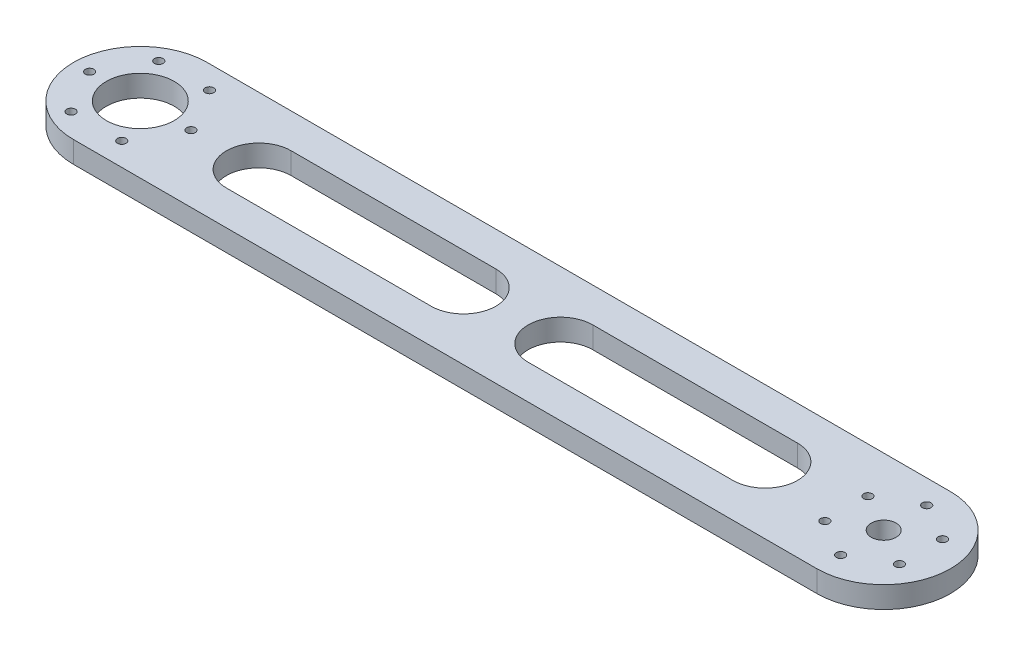
ISO-10303-21;
HEADER;
FILE_DESCRIPTION(('STEP AP214'),'2;1');
FILE_NAME('part.step','',(''),(''),'','','');
FILE_SCHEMA(('AUTOMOTIVE_DESIGN { 1 0 10303 214 1 1 1 1 }'));
ENDSEC;
DATA;
#1=APPLICATION_CONTEXT('core data for automotive mechanical design processes');
#2=APPLICATION_PROTOCOL_DEFINITION('international standard','automotive_design',2000,#1);
#3=PRODUCT_CONTEXT('',#1,'mechanical');
#4=PRODUCT('Part','Part','',(#3));
#5=PRODUCT_RELATED_PRODUCT_CATEGORY('part','',(#4));
#6=PRODUCT_DEFINITION_FORMATION('','',#4);
#7=PRODUCT_DEFINITION_CONTEXT('part definition',#1,'design');
#8=PRODUCT_DEFINITION('design','',#6,#7);
#9=PRODUCT_DEFINITION_SHAPE('','',#8);
#10=(LENGTH_UNIT() NAMED_UNIT(*) SI_UNIT(.MILLI.,.METRE.));
#11=(NAMED_UNIT(*) PLANE_ANGLE_UNIT() SI_UNIT($,.RADIAN.));
#12=(NAMED_UNIT(*) SI_UNIT($,.STERADIAN.) SOLID_ANGLE_UNIT());
#13=UNCERTAINTY_MEASURE_WITH_UNIT(LENGTH_MEASURE(1.E-05),#10,'distance_accuracy_value','');
#14=(GEOMETRIC_REPRESENTATION_CONTEXT(3) GLOBAL_UNCERTAINTY_ASSIGNED_CONTEXT((#13)) GLOBAL_UNIT_ASSIGNED_CONTEXT((#10,
#11,#12)) REPRESENTATION_CONTEXT('',''));
#15=CARTESIAN_POINT('',(0.,0.,0.));
#16=DIRECTION('',(0.,0.,1.));
#17=DIRECTION('',(1.,0.,0.));
#18=AXIS2_PLACEMENT_3D('',#15,#16,#17);
#19=CARTESIAN_POINT('',(-104.546683395043,10.,0.));
#20=DIRECTION('',(0.,1.,0.));
#21=DIRECTION('',(0.,0.,1.));
#22=AXIS2_PLACEMENT_3D('',#19,#20,#21);
#23=PLANE('',#22);
#24=CARTESIAN_POINT('',(-92.8085230633689,10.,20.3447613532394));
#25=DIRECTION('',(0.,1.,0.));
#26=DIRECTION('',(0.,0.,1.));
#27=AXIS2_PLACEMENT_3D('',#24,#25,#26);
#28=CIRCLE('',#27,1.99999999999998);
#29=CARTESIAN_POINT('',(-92.8085230633689,10.,22.3447613532394));
#30=VERTEX_POINT('',#29);
#31=EDGE_CURVE('E196',#30,#30,#28,.T.);
#32=ORIENTED_EDGE('',*,*,#31,.F.);
#33=EDGE_LOOP('',(#32));
#34=FACE_BOUND('',#33,.T.);
#35=CARTESIAN_POINT('',(-92.8085230633687,10.,-20.3447613532391));
#36=DIRECTION('',(0.,1.,0.));
#37=DIRECTION('',(0.,0.,1.));
#38=AXIS2_PLACEMENT_3D('',#35,#36,#37);
#39=CIRCLE('',#38,2.);
#40=CARTESIAN_POINT('',(-92.8085230633687,10.,-18.3447613532391));
#41=VERTEX_POINT('',#40);
#42=EDGE_CURVE('E208',#41,#41,#39,.T.);
#43=ORIENTED_EDGE('',*,*,#42,.F.);
#44=EDGE_LOOP('',(#43));
#45=FACE_BOUND('',#44,.T.);
#46=CARTESIAN_POINT('',(240.44542349274,10.,19.9863287286099));
#47=DIRECTION('',(0.,1.,0.));
#48=DIRECTION('',(0.,0.,1.));
#49=AXIS2_PLACEMENT_3D('',#46,#47,#48);
#50=CIRCLE('',#49,2.00000000000003);
#51=CARTESIAN_POINT('',(240.44542349274,10.,21.98632872861));
#52=VERTEX_POINT('',#51);
#53=EDGE_CURVE('E220',#52,#52,#50,.T.);
#54=ORIENTED_EDGE('',*,*,#53,.F.);
#55=EDGE_LOOP('',(#54));
#56=FACE_BOUND('',#55,.T.);
#57=CARTESIAN_POINT('',(257.750145343994,10.,9.98632872861002));
#58=DIRECTION('',(0.,1.,0.));
#59=DIRECTION('',(0.,0.,1.));
#60=AXIS2_PLACEMENT_3D('',#57,#58,#59);
#61=CIRCLE('',#60,2.);
#62=CARTESIAN_POINT('',(257.750145343994,10.,11.98632872861));
#63=VERTEX_POINT('',#62);
#64=EDGE_CURVE('E232',#63,#63,#61,.T.);
#65=ORIENTED_EDGE('',*,*,#64,.F.);
#66=EDGE_LOOP('',(#65));
#67=FACE_BOUND('',#66,.T.);
#68=CARTESIAN_POINT('',(240.429637268305,10.,-19.9863287286099));
#69=DIRECTION('',(0.,1.,0.));
#70=DIRECTION('',(0.,0.,1.));
#71=AXIS2_PLACEMENT_3D('',#68,#69,#70);
#72=CIRCLE('',#71,1.99999999999997);
#73=CARTESIAN_POINT('',(240.429637268305,10.,-17.98632872861));
#74=VERTEX_POINT('',#73);
#75=EDGE_CURVE('E244',#74,#74,#72,.T.);
#76=ORIENTED_EDGE('',*,*,#75,.F.);
#77=EDGE_LOOP('',(#76));
#78=FACE_BOUND('',#77,.T.);
#79=CARTESIAN_POINT('',(223.132808529268,10.,9.99999999999991));
#80=DIRECTION('',(0.,1.,0.));
#81=DIRECTION('',(0.,0.,1.));
#82=AXIS2_PLACEMENT_3D('',#79,#80,#81);
#83=CIRCLE('',#82,2.);
#84=CARTESIAN_POINT('',(223.132808529268,10.,11.9999999999999));
#85=VERTEX_POINT('',#84);
#86=EDGE_CURVE('E256',#85,#85,#83,.T.);
#87=ORIENTED_EDGE('',*,*,#86,.F.);
#88=EDGE_LOOP('',(#87));
#89=FACE_BOUND('',#88,.T.);
#90=CARTESIAN_POINT('',(-104.546683395043,10.,0.));
#91=DIRECTION('',(0.,1.,0.));
#92=DIRECTION('',(0.,0.,1.));
#93=AXIS2_PLACEMENT_3D('',#90,#91,#92);
#94=CIRCLE('',#93,15.75);
#95=CARTESIAN_POINT('',(-104.546683395043,10.,15.75));
#96=VERTEX_POINT('',#95);
#97=EDGE_CURVE('E268',#96,#96,#94,.T.);
#98=ORIENTED_EDGE('',*,*,#97,.F.);
#99=EDGE_LOOP('',(#98));
#100=FACE_BOUND('',#99,.T.);
#101=CARTESIAN_POINT('',(-104.546683395043,10.,0.));
#102=DIRECTION('',(0.,1.,0.));
#103=DIRECTION('',(0.,0.,1.));
#104=AXIS2_PLACEMENT_3D('',#101,#102,#103);
#105=CIRCLE('',#104,31.);
#106=CARTESIAN_POINT('',(-104.546683395043,10.,-31.));
#107=VERTEX_POINT('',#106);
#108=CARTESIAN_POINT('',(-104.546683395043,10.,31.));
#109=VERTEX_POINT('',#108);
#110=EDGE_CURVE('E274',#107,#109,#105,.T.);
#111=ORIENTED_EDGE('',*,*,#110,.T.);
#112=DIRECTION('',(1.,0.,0.));
#113=VECTOR('',#112,1.);
#114=CARTESIAN_POINT('',(-104.546683395043,10.,31.));
#115=LINE('',#114,#113);
#116=CARTESIAN_POINT('',(240.453316604957,10.,31.));
#117=VERTEX_POINT('',#116);
#118=EDGE_CURVE('E277',#109,#117,#115,.T.);
#119=ORIENTED_EDGE('',*,*,#118,.T.);
#120=CARTESIAN_POINT('',(240.453316604957,10.,0.));
#121=DIRECTION('',(0.,1.,0.));
#122=DIRECTION('',(0.,0.,1.));
#123=AXIS2_PLACEMENT_3D('',#120,#121,#122);
#124=CIRCLE('',#123,31.);
#125=CARTESIAN_POINT('',(240.453316604957,10.,-31.));
#126=VERTEX_POINT('',#125);
#127=EDGE_CURVE('E280',#117,#126,#124,.T.);
#128=ORIENTED_EDGE('',*,*,#127,.T.);
#129=DIRECTION('',(-1.,0.,0.));
#130=VECTOR('',#129,1.);
#131=CARTESIAN_POINT('',(-104.546683395043,10.,-31.));
#132=LINE('',#131,#130);
#133=EDGE_CURVE('E282',#126,#107,#132,.T.);
#134=ORIENTED_EDGE('',*,*,#133,.T.);
#135=EDGE_LOOP('',(#111,#119,#128,#134));
#136=FACE_BOUND('',#135,.T.);
#137=CARTESIAN_POINT('',(240.453316604957,10.,0.));
#138=DIRECTION('',(0.,1.,0.));
#139=DIRECTION('',(0.,0.,1.));
#140=AXIS2_PLACEMENT_3D('',#137,#138,#139);
#141=CIRCLE('',#140,5.75);
#142=CARTESIAN_POINT('',(240.453316604957,10.,5.75));
#143=VERTEX_POINT('',#142);
#144=EDGE_CURVE('E262',#143,#143,#141,.T.);
#145=ORIENTED_EDGE('',*,*,#144,.F.);
#146=EDGE_LOOP('',(#145));
#147=FACE_BOUND('',#146,.T.);
#148=CARTESIAN_POINT('',(223.124915417051,10.,-9.98632872861002));
#149=DIRECTION('',(0.,1.,0.));
#150=DIRECTION('',(0.,0.,1.));
#151=AXIS2_PLACEMENT_3D('',#148,#149,#150);
#152=CIRCLE('',#151,2.00000000000003);
#153=CARTESIAN_POINT('',(223.124915417051,10.,-7.98632872861));
#154=VERTEX_POINT('',#153);
#155=EDGE_CURVE('E250',#154,#154,#152,.T.);
#156=ORIENTED_EDGE('',*,*,#155,.F.);
#157=EDGE_LOOP('',(#156));
#158=FACE_BOUND('',#157,.T.);
#159=CARTESIAN_POINT('',(257.742252231777,10.,-9.9999999999999));
#160=DIRECTION('',(0.,1.,0.));
#161=DIRECTION('',(0.,0.,1.));
#162=AXIS2_PLACEMENT_3D('',#159,#160,#161);
#163=CIRCLE('',#162,2.00000000000005);
#164=CARTESIAN_POINT('',(257.742252231777,10.,-7.99999999999985));
#165=VERTEX_POINT('',#164);
#166=EDGE_CURVE('E238',#165,#165,#163,.T.);
#167=ORIENTED_EDGE('',*,*,#166,.F.);
#168=EDGE_LOOP('',(#167));
#169=FACE_BOUND('',#168,.T.);
#170=CARTESIAN_POINT('',(-128.046683395043,10.,0.));
#171=DIRECTION('',(0.,1.,0.));
#172=DIRECTION('',(0.,0.,1.));
#173=AXIS2_PLACEMENT_3D('',#170,#171,#172);
#174=CIRCLE('',#173,2.);
#175=CARTESIAN_POINT('',(-128.046683395043,10.,2.));
#176=VERTEX_POINT('',#175);
#177=EDGE_CURVE('E226',#176,#176,#174,.T.);
#178=ORIENTED_EDGE('',*,*,#177,.F.);
#179=EDGE_LOOP('',(#178));
#180=FACE_BOUND('',#179,.T.);
#181=CARTESIAN_POINT('',(-116.300629951151,10.,-20.3447613532392));
#182=DIRECTION('',(0.,1.,0.));
#183=DIRECTION('',(0.,0.,1.));
#184=AXIS2_PLACEMENT_3D('',#181,#182,#183);
#185=CIRCLE('',#184,2.);
#186=CARTESIAN_POINT('',(-116.300629951151,10.,-18.3447613532392));
#187=VERTEX_POINT('',#186);
#188=EDGE_CURVE('E214',#187,#187,#185,.T.);
#189=ORIENTED_EDGE('',*,*,#188,.F.);
#190=EDGE_LOOP('',(#189));
#191=FACE_BOUND('',#190,.T.);
#192=CARTESIAN_POINT('',(-81.0624696194774,10.,1.64099622925627E-13));
#193=DIRECTION('',(0.,1.,0.));
#194=DIRECTION('',(0.,0.,1.));
#195=AXIS2_PLACEMENT_3D('',#192,#193,#194);
#196=CIRCLE('',#195,1.99999999999999);
#197=CARTESIAN_POINT('',(-81.0624696194774,10.,2.00000000000016));
#198=VERTEX_POINT('',#197);
#199=EDGE_CURVE('E202',#198,#198,#196,.T.);
#200=ORIENTED_EDGE('',*,*,#199,.F.);
#201=EDGE_LOOP('',(#200));
#202=FACE_BOUND('',#201,.T.);
#203=CARTESIAN_POINT('',(-116.300629951152,10.,20.3447613532393));
#204=DIRECTION('',(0.,1.,0.));
#205=DIRECTION('',(0.,0.,1.));
#206=AXIS2_PLACEMENT_3D('',#203,#204,#205);
#207=CIRCLE('',#206,1.99999999999998);
#208=CARTESIAN_POINT('',(-116.300629951152,10.,22.3447613532393));
#209=VERTEX_POINT('',#208);
#210=EDGE_CURVE('E190',#209,#209,#207,.T.);
#211=ORIENTED_EDGE('',*,*,#210,.F.);
#212=EDGE_LOOP('',(#211));
#213=FACE_BOUND('',#212,.T.);
#214=DIRECTION('',(1.,0.,0.));
#215=VECTOR('',#214,1.);
#216=CARTESIAN_POINT('',(-49.5466833950429,10.,15.));
#217=LINE('',#216,#215);
#218=CARTESIAN_POINT('',(-49.5466833950429,10.,15.));
#219=VERTEX_POINT('',#218);
#220=CARTESIAN_POINT('',(45.4533166049571,10.,15.));
#221=VERTEX_POINT('',#220);
#222=EDGE_CURVE('E161',#219,#221,#217,.T.);
#223=ORIENTED_EDGE('',*,*,#222,.F.);
#224=CARTESIAN_POINT('',(-49.5466833950429,10.,0.));
#225=DIRECTION('',(0.,1.,0.));
#226=DIRECTION('',(0.,0.,1.));
#227=AXIS2_PLACEMENT_3D('',#224,#225,#226);
#228=CIRCLE('',#227,15.);
#229=CARTESIAN_POINT('',(-49.5466833950429,10.,-15.));
#230=VERTEX_POINT('',#229);
#231=EDGE_CURVE('E159',#230,#219,#228,.T.);
#232=ORIENTED_EDGE('',*,*,#231,.F.);
#233=DIRECTION('',(-1.,0.,0.));
#234=VECTOR('',#233,1.);
#235=CARTESIAN_POINT('',(-49.5466833950429,10.,-15.));
#236=LINE('',#235,#234);
#237=CARTESIAN_POINT('',(45.4533166049571,10.,-15.));
#238=VERTEX_POINT('',#237);
#239=EDGE_CURVE('E167',#238,#230,#236,.T.);
#240=ORIENTED_EDGE('',*,*,#239,.F.);
#241=CARTESIAN_POINT('',(45.4533166049571,10.,0.));
#242=DIRECTION('',(0.,1.,0.));
#243=DIRECTION('',(0.,0.,1.));
#244=AXIS2_PLACEMENT_3D('',#241,#242,#243);
#245=CIRCLE('',#244,15.);
#246=EDGE_CURVE('E164',#221,#238,#245,.T.);
#247=ORIENTED_EDGE('',*,*,#246,.F.);
#248=EDGE_LOOP('',(#223,#232,#240,#247));
#249=FACE_BOUND('',#248,.T.);
#250=DIRECTION('',(1.,0.,0.));
#251=VECTOR('',#250,1.);
#252=CARTESIAN_POINT('',(90.4533166049571,10.,15.));
#253=LINE('',#252,#251);
#254=CARTESIAN_POINT('',(90.4533166049571,10.,15.));
#255=VERTEX_POINT('',#254);
#256=CARTESIAN_POINT('',(185.453316604957,10.,15.));
#257=VERTEX_POINT('',#256);
#258=EDGE_CURVE('E131',#255,#257,#253,.T.);
#259=ORIENTED_EDGE('',*,*,#258,.F.);
#260=CARTESIAN_POINT('',(90.4533166049571,10.,0.));
#261=DIRECTION('',(0.,1.,0.));
#262=DIRECTION('',(0.,0.,1.));
#263=AXIS2_PLACEMENT_3D('',#260,#261,#262);
#264=CIRCLE('',#263,15.);
#265=CARTESIAN_POINT('',(90.4533166049571,10.,-15.));
#266=VERTEX_POINT('',#265);
#267=EDGE_CURVE('E123',#266,#255,#264,.T.);
#268=ORIENTED_EDGE('',*,*,#267,.F.);
#269=DIRECTION('',(-1.,0.,0.));
#270=VECTOR('',#269,1.);
#271=CARTESIAN_POINT('',(90.4533166049571,10.,-15.));
#272=LINE('',#271,#270);
#273=CARTESIAN_POINT('',(185.453316604957,10.,-15.));
#274=VERTEX_POINT('',#273);
#275=EDGE_CURVE('E145',#274,#266,#272,.T.);
#276=ORIENTED_EDGE('',*,*,#275,.F.);
#277=CARTESIAN_POINT('',(185.453316604957,10.,0.));
#278=DIRECTION('',(0.,1.,0.));
#279=DIRECTION('',(0.,0.,1.));
#280=AXIS2_PLACEMENT_3D('',#277,#278,#279);
#281=CIRCLE('',#280,15.);
#282=EDGE_CURVE('E143',#257,#274,#281,.T.);
#283=ORIENTED_EDGE('',*,*,#282,.F.);
#284=EDGE_LOOP('',(#259,#268,#276,#283));
#285=FACE_BOUND('',#284,.T.);
#286=ADVANCED_FACE('F34',(#34,#45,#56,#67,#78,#89,#100,#136,#147,#158,#169,#180,#191,#202,#213,
#249,#285),#23,.T.);
#287=CARTESIAN_POINT('',(-104.546683395043,0.,0.));
#288=DIRECTION('',(0.,1.,0.));
#289=DIRECTION('',(0.,0.,1.));
#290=AXIS2_PLACEMENT_3D('',#287,#288,#289);
#291=PLANE('',#290);
#292=CARTESIAN_POINT('',(-49.5466833950429,0.,0.));
#293=DIRECTION('',(0.,1.,0.));
#294=DIRECTION('',(0.,0.,1.));
#295=AXIS2_PLACEMENT_3D('',#292,#293,#294);
#296=CIRCLE('',#295,15.);
#297=CARTESIAN_POINT('',(-49.5466833950429,0.,-15.));
#298=VERTEX_POINT('',#297);
#299=CARTESIAN_POINT('',(-49.5466833950429,0.,15.));
#300=VERTEX_POINT('',#299);
#301=EDGE_CURVE('E139',#298,#300,#296,.T.);
#302=ORIENTED_EDGE('',*,*,#301,.T.);
#303=DIRECTION('',(1.,0.,0.));
#304=VECTOR('',#303,1.);
#305=CARTESIAN_POINT('',(-49.5466833950429,0.,15.));
#306=LINE('',#305,#304);
#307=CARTESIAN_POINT('',(45.4533166049571,0.,15.));
#308=VERTEX_POINT('',#307);
#309=EDGE_CURVE('E172',#300,#308,#306,.T.);
#310=ORIENTED_EDGE('',*,*,#309,.T.);
#311=CARTESIAN_POINT('',(45.4533166049571,0.,0.));
#312=DIRECTION('',(0.,1.,0.));
#313=DIRECTION('',(0.,0.,1.));
#314=AXIS2_PLACEMENT_3D('',#311,#312,#313);
#315=CIRCLE('',#314,15.);
#316=CARTESIAN_POINT('',(45.4533166049571,0.,-15.));
#317=VERTEX_POINT('',#316);
#318=EDGE_CURVE('E175',#308,#317,#315,.T.);
#319=ORIENTED_EDGE('',*,*,#318,.T.);
#320=DIRECTION('',(-1.,0.,0.));
#321=VECTOR('',#320,1.);
#322=CARTESIAN_POINT('',(-49.5466833950429,0.,-15.));
#323=LINE('',#322,#321);
#324=EDGE_CURVE('E162',#317,#298,#323,.T.);
#325=ORIENTED_EDGE('',*,*,#324,.T.);
#326=EDGE_LOOP('',(#302,#310,#319,#325));
#327=FACE_BOUND('',#326,.T.);
#328=CARTESIAN_POINT('',(-104.546683395043,0.,0.));
#329=DIRECTION('',(0.,1.,0.));
#330=DIRECTION('',(0.,0.,1.));
#331=AXIS2_PLACEMENT_3D('',#328,#329,#330);
#332=CIRCLE('',#331,31.);
#333=CARTESIAN_POINT('',(-104.546683395043,0.,-31.));
#334=VERTEX_POINT('',#333);
#335=CARTESIAN_POINT('',(-104.546683395043,0.,31.));
#336=VERTEX_POINT('',#335);
#337=EDGE_CURVE('E271',#334,#336,#332,.T.);
#338=ORIENTED_EDGE('',*,*,#337,.F.);
#339=DIRECTION('',(-1.,0.,0.));
#340=VECTOR('',#339,1.);
#341=CARTESIAN_POINT('',(-104.546683395043,0.,-31.));
#342=LINE('',#341,#340);
#343=CARTESIAN_POINT('',(240.453316604957,0.,-31.));
#344=VERTEX_POINT('',#343);
#345=EDGE_CURVE('E278',#344,#334,#342,.T.);
#346=ORIENTED_EDGE('',*,*,#345,.F.);
#347=CARTESIAN_POINT('',(240.453316604957,0.,0.));
#348=DIRECTION('',(0.,1.,0.));
#349=DIRECTION('',(0.,0.,1.));
#350=AXIS2_PLACEMENT_3D('',#347,#348,#349);
#351=CIRCLE('',#350,31.);
#352=CARTESIAN_POINT('',(240.453316604957,0.,31.));
#353=VERTEX_POINT('',#352);
#354=EDGE_CURVE('E289',#353,#344,#351,.T.);
#355=ORIENTED_EDGE('',*,*,#354,.F.);
#356=DIRECTION('',(1.,0.,0.));
#357=VECTOR('',#356,1.);
#358=CARTESIAN_POINT('',(-104.546683395043,0.,31.));
#359=LINE('',#358,#357);
#360=EDGE_CURVE('E287',#336,#353,#359,.T.);
#361=ORIENTED_EDGE('',*,*,#360,.F.);
#362=EDGE_LOOP('',(#338,#346,#355,#361));
#363=FACE_BOUND('',#362,.T.);
#364=CARTESIAN_POINT('',(-104.546683395043,0.,0.));
#365=DIRECTION('',(0.,1.,0.));
#366=DIRECTION('',(0.,0.,1.));
#367=AXIS2_PLACEMENT_3D('',#364,#365,#366);
#368=CIRCLE('',#367,15.75);
#369=CARTESIAN_POINT('',(-104.546683395043,0.,15.75));
#370=VERTEX_POINT('',#369);
#371=EDGE_CURVE('E265',#370,#370,#368,.T.);
#372=ORIENTED_EDGE('',*,*,#371,.T.);
#373=EDGE_LOOP('',(#372));
#374=FACE_BOUND('',#373,.T.);
#375=CARTESIAN_POINT('',(240.453316604957,0.,0.));
#376=DIRECTION('',(0.,1.,0.));
#377=DIRECTION('',(0.,0.,1.));
#378=AXIS2_PLACEMENT_3D('',#375,#376,#377);
#379=CIRCLE('',#378,5.75);
#380=CARTESIAN_POINT('',(240.453316604957,0.,5.75));
#381=VERTEX_POINT('',#380);
#382=EDGE_CURVE('E259',#381,#381,#379,.T.);
#383=ORIENTED_EDGE('',*,*,#382,.T.);
#384=EDGE_LOOP('',(#383));
#385=FACE_BOUND('',#384,.T.);
#386=CARTESIAN_POINT('',(223.132808529268,0.,9.99999999999991));
#387=DIRECTION('',(0.,1.,0.));
#388=DIRECTION('',(0.,0.,1.));
#389=AXIS2_PLACEMENT_3D('',#386,#387,#388);
#390=CIRCLE('',#389,2.);
#391=CARTESIAN_POINT('',(223.132808529268,0.,11.9999999999999));
#392=VERTEX_POINT('',#391);
#393=EDGE_CURVE('E253',#392,#392,#390,.T.);
#394=ORIENTED_EDGE('',*,*,#393,.T.);
#395=EDGE_LOOP('',(#394));
#396=FACE_BOUND('',#395,.T.);
#397=CARTESIAN_POINT('',(223.124915417051,0.,-9.98632872861002));
#398=DIRECTION('',(0.,1.,0.));
#399=DIRECTION('',(0.,0.,1.));
#400=AXIS2_PLACEMENT_3D('',#397,#398,#399);
#401=CIRCLE('',#400,2.00000000000003);
#402=CARTESIAN_POINT('',(223.124915417051,0.,-7.98632872861));
#403=VERTEX_POINT('',#402);
#404=EDGE_CURVE('E247',#403,#403,#401,.T.);
#405=ORIENTED_EDGE('',*,*,#404,.T.);
#406=EDGE_LOOP('',(#405));
#407=FACE_BOUND('',#406,.T.);
#408=CARTESIAN_POINT('',(240.429637268305,0.,-19.9863287286099));
#409=DIRECTION('',(0.,1.,0.));
#410=DIRECTION('',(0.,0.,1.));
#411=AXIS2_PLACEMENT_3D('',#408,#409,#410);
#412=CIRCLE('',#411,1.99999999999997);
#413=CARTESIAN_POINT('',(240.429637268305,0.,-17.98632872861));
#414=VERTEX_POINT('',#413);
#415=EDGE_CURVE('E241',#414,#414,#412,.T.);
#416=ORIENTED_EDGE('',*,*,#415,.T.);
#417=EDGE_LOOP('',(#416));
#418=FACE_BOUND('',#417,.T.);
#419=CARTESIAN_POINT('',(257.742252231777,0.,-9.9999999999999));
#420=DIRECTION('',(0.,1.,0.));
#421=DIRECTION('',(0.,0.,1.));
#422=AXIS2_PLACEMENT_3D('',#419,#420,#421);
#423=CIRCLE('',#422,2.00000000000005);
#424=CARTESIAN_POINT('',(257.742252231777,0.,-7.99999999999985));
#425=VERTEX_POINT('',#424);
#426=EDGE_CURVE('E235',#425,#425,#423,.T.);
#427=ORIENTED_EDGE('',*,*,#426,.T.);
#428=EDGE_LOOP('',(#427));
#429=FACE_BOUND('',#428,.T.);
#430=CARTESIAN_POINT('',(257.750145343994,0.,9.98632872861002));
#431=DIRECTION('',(0.,1.,0.));
#432=DIRECTION('',(0.,0.,1.));
#433=AXIS2_PLACEMENT_3D('',#430,#431,#432);
#434=CIRCLE('',#433,2.);
#435=CARTESIAN_POINT('',(257.750145343994,0.,11.98632872861));
#436=VERTEX_POINT('',#435);
#437=EDGE_CURVE('E229',#436,#436,#434,.T.);
#438=ORIENTED_EDGE('',*,*,#437,.T.);
#439=EDGE_LOOP('',(#438));
#440=FACE_BOUND('',#439,.T.);
#441=CARTESIAN_POINT('',(-128.046683395043,0.,0.));
#442=DIRECTION('',(0.,1.,0.));
#443=DIRECTION('',(0.,0.,1.));
#444=AXIS2_PLACEMENT_3D('',#441,#442,#443);
#445=CIRCLE('',#444,2.);
#446=CARTESIAN_POINT('',(-128.046683395043,0.,2.));
#447=VERTEX_POINT('',#446);
#448=EDGE_CURVE('E223',#447,#447,#445,.T.);
#449=ORIENTED_EDGE('',*,*,#448,.T.);
#450=EDGE_LOOP('',(#449));
#451=FACE_BOUND('',#450,.T.);
#452=CARTESIAN_POINT('',(240.44542349274,0.,19.9863287286099));
#453=DIRECTION('',(0.,1.,0.));
#454=DIRECTION('',(0.,0.,1.));
#455=AXIS2_PLACEMENT_3D('',#452,#453,#454);
#456=CIRCLE('',#455,2.00000000000003);
#457=CARTESIAN_POINT('',(240.44542349274,0.,21.98632872861));
#458=VERTEX_POINT('',#457);
#459=EDGE_CURVE('E217',#458,#458,#456,.T.);
#460=ORIENTED_EDGE('',*,*,#459,.T.);
#461=EDGE_LOOP('',(#460));
#462=FACE_BOUND('',#461,.T.);
#463=CARTESIAN_POINT('',(-116.300629951151,0.,-20.3447613532392));
#464=DIRECTION('',(0.,1.,0.));
#465=DIRECTION('',(0.,0.,1.));
#466=AXIS2_PLACEMENT_3D('',#463,#464,#465);
#467=CIRCLE('',#466,2.);
#468=CARTESIAN_POINT('',(-116.300629951151,0.,-18.3447613532392));
#469=VERTEX_POINT('',#468);
#470=EDGE_CURVE('E211',#469,#469,#467,.T.);
#471=ORIENTED_EDGE('',*,*,#470,.T.);
#472=EDGE_LOOP('',(#471));
#473=FACE_BOUND('',#472,.T.);
#474=CARTESIAN_POINT('',(-92.8085230633687,0.,-20.3447613532391));
#475=DIRECTION('',(0.,1.,0.));
#476=DIRECTION('',(0.,0.,1.));
#477=AXIS2_PLACEMENT_3D('',#474,#475,#476);
#478=CIRCLE('',#477,2.);
#479=CARTESIAN_POINT('',(-92.8085230633687,0.,-18.3447613532391));
#480=VERTEX_POINT('',#479);
#481=EDGE_CURVE('E205',#480,#480,#478,.T.);
#482=ORIENTED_EDGE('',*,*,#481,.T.);
#483=EDGE_LOOP('',(#482));
#484=FACE_BOUND('',#483,.T.);
#485=CARTESIAN_POINT('',(-81.0624696194774,0.,1.64099622925627E-13));
#486=DIRECTION('',(0.,1.,0.));
#487=DIRECTION('',(0.,0.,1.));
#488=AXIS2_PLACEMENT_3D('',#485,#486,#487);
#489=CIRCLE('',#488,1.99999999999999);
#490=CARTESIAN_POINT('',(-81.0624696194774,0.,2.00000000000016));
#491=VERTEX_POINT('',#490);
#492=EDGE_CURVE('E199',#491,#491,#489,.T.);
#493=ORIENTED_EDGE('',*,*,#492,.T.);
#494=EDGE_LOOP('',(#493));
#495=FACE_BOUND('',#494,.T.);
#496=CARTESIAN_POINT('',(-92.8085230633689,0.,20.3447613532394));
#497=DIRECTION('',(0.,1.,0.));
#498=DIRECTION('',(0.,0.,1.));
#499=AXIS2_PLACEMENT_3D('',#496,#497,#498);
#500=CIRCLE('',#499,1.99999999999998);
#501=CARTESIAN_POINT('',(-92.8085230633689,0.,22.3447613532394));
#502=VERTEX_POINT('',#501);
#503=EDGE_CURVE('E193',#502,#502,#500,.T.);
#504=ORIENTED_EDGE('',*,*,#503,.T.);
#505=EDGE_LOOP('',(#504));
#506=FACE_BOUND('',#505,.T.);
#507=CARTESIAN_POINT('',(-116.300629951152,0.,20.3447613532393));
#508=DIRECTION('',(0.,1.,0.));
#509=DIRECTION('',(0.,0.,1.));
#510=AXIS2_PLACEMENT_3D('',#507,#508,#509);
#511=CIRCLE('',#510,1.99999999999998);
#512=CARTESIAN_POINT('',(-116.300629951152,0.,22.3447613532393));
#513=VERTEX_POINT('',#512);
#514=EDGE_CURVE('E189',#513,#513,#511,.T.);
#515=ORIENTED_EDGE('',*,*,#514,.T.);
#516=EDGE_LOOP('',(#515));
#517=FACE_BOUND('',#516,.T.);
#518=CARTESIAN_POINT('',(90.4533166049571,0.,0.));
#519=DIRECTION('',(0.,1.,0.));
#520=DIRECTION('',(0.,0.,1.));
#521=AXIS2_PLACEMENT_3D('',#518,#519,#520);
#522=CIRCLE('',#521,15.);
#523=CARTESIAN_POINT('',(90.4533166049571,0.,-15.));
#524=VERTEX_POINT('',#523);
#525=CARTESIAN_POINT('',(90.4533166049571,0.,15.));
#526=VERTEX_POINT('',#525);
#527=EDGE_CURVE('E57',#524,#526,#522,.T.);
#528=ORIENTED_EDGE('',*,*,#527,.T.);
#529=DIRECTION('',(1.,0.,0.));
#530=VECTOR('',#529,1.);
#531=CARTESIAN_POINT('',(90.4533166049571,0.,15.));
#532=LINE('',#531,#530);
#533=CARTESIAN_POINT('',(185.453316604957,0.,15.));
#534=VERTEX_POINT('',#533);
#535=EDGE_CURVE('E138',#526,#534,#532,.T.);
#536=ORIENTED_EDGE('',*,*,#535,.T.);
#537=CARTESIAN_POINT('',(185.453316604957,0.,0.));
#538=DIRECTION('',(0.,1.,0.));
#539=DIRECTION('',(0.,0.,1.));
#540=AXIS2_PLACEMENT_3D('',#537,#538,#539);
#541=CIRCLE('',#540,15.);
#542=CARTESIAN_POINT('',(185.453316604957,0.,-15.));
#543=VERTEX_POINT('',#542);
#544=EDGE_CURVE('E151',#534,#543,#541,.T.);
#545=ORIENTED_EDGE('',*,*,#544,.T.);
#546=DIRECTION('',(-1.,0.,0.));
#547=VECTOR('',#546,1.);
#548=CARTESIAN_POINT('',(90.4533166049571,0.,-15.));
#549=LINE('',#548,#547);
#550=EDGE_CURVE('E132',#543,#524,#549,.T.);
#551=ORIENTED_EDGE('',*,*,#550,.T.);
#552=EDGE_LOOP('',(#528,#536,#545,#551));
#553=FACE_BOUND('',#552,.T.);
#554=ADVANCED_FACE('F307',(#327,#363,#374,#385,#396,#407,#418,#429,#440,#451,#462,#473,#484,
#495,#506,#517,#553),#291,.F.);
#555=CARTESIAN_POINT('',(-104.546683395043,10.,0.));
#556=DIRECTION('',(0.,-1.,0.));
#557=DIRECTION('',(0.,0.,-1.));
#558=AXIS2_PLACEMENT_3D('',#555,#556,#557);
#559=CYLINDRICAL_SURFACE('',#558,31.);
#560=ORIENTED_EDGE('',*,*,#337,.T.);
#561=DIRECTION('',(0.,-1.,0.));
#562=VECTOR('',#561,1.);
#563=CARTESIAN_POINT('',(-104.546683395043,10.,31.));
#564=LINE('',#563,#562);
#565=EDGE_CURVE('E11',#109,#336,#564,.T.);
#566=ORIENTED_EDGE('',*,*,#565,.F.);
#567=ORIENTED_EDGE('',*,*,#110,.F.);
#568=DIRECTION('',(0.,-1.,0.));
#569=VECTOR('',#568,1.);
#570=CARTESIAN_POINT('',(-104.546683395043,10.,-31.));
#571=LINE('',#570,#569);
#572=EDGE_CURVE('E284',#107,#334,#571,.T.);
#573=ORIENTED_EDGE('',*,*,#572,.T.);
#574=EDGE_LOOP('',(#560,#566,#567,#573));
#575=FACE_BOUND('',#574,.T.);
#576=ADVANCED_FACE('F36',(#575),#559,.T.);
#577=CARTESIAN_POINT('',(-104.546683395043,10.,31.));
#578=DIRECTION('',(0.,0.,-1.));
#579=DIRECTION('',(-1.,0.,0.));
#580=AXIS2_PLACEMENT_3D('',#577,#578,#579);
#581=PLANE('',#580);
#582=ORIENTED_EDGE('',*,*,#360,.T.);
#583=DIRECTION('',(0.,-1.,0.));
#584=VECTOR('',#583,1.);
#585=CARTESIAN_POINT('',(240.453316604957,10.,31.));
#586=LINE('',#585,#584);
#587=EDGE_CURVE('E42',#117,#353,#586,.T.);
#588=ORIENTED_EDGE('',*,*,#587,.F.);
#589=ORIENTED_EDGE('',*,*,#118,.F.);
#590=ORIENTED_EDGE('',*,*,#565,.T.);
#591=EDGE_LOOP('',(#582,#588,#589,#590));
#592=FACE_BOUND('',#591,.T.);
#593=ADVANCED_FACE('F318',(#592),#581,.F.);
#594=CARTESIAN_POINT('',(240.453316604957,10.,0.));
#595=DIRECTION('',(0.,-1.,0.));
#596=DIRECTION('',(0.,0.,-1.));
#597=AXIS2_PLACEMENT_3D('',#594,#595,#596);
#598=CYLINDRICAL_SURFACE('',#597,31.);
#599=ORIENTED_EDGE('',*,*,#354,.T.);
#600=DIRECTION('',(0.,-1.,0.));
#601=VECTOR('',#600,1.);
#602=CARTESIAN_POINT('',(240.453316604957,10.,-31.));
#603=LINE('',#602,#601);
#604=EDGE_CURVE('E294',#126,#344,#603,.T.);
#605=ORIENTED_EDGE('',*,*,#604,.F.);
#606=ORIENTED_EDGE('',*,*,#127,.F.);
#607=ORIENTED_EDGE('',*,*,#587,.T.);
#608=EDGE_LOOP('',(#599,#605,#606,#607));
#609=FACE_BOUND('',#608,.T.);
#610=ADVANCED_FACE('F301',(#609),#598,.T.);
#611=CARTESIAN_POINT('',(-104.546683395043,10.,-31.));
#612=DIRECTION('',(0.,0.,1.));
#613=DIRECTION('',(1.,0.,0.));
#614=AXIS2_PLACEMENT_3D('',#611,#612,#613);
#615=PLANE('',#614);
#616=ORIENTED_EDGE('',*,*,#345,.T.);
#617=ORIENTED_EDGE('',*,*,#572,.F.);
#618=ORIENTED_EDGE('',*,*,#133,.F.);
#619=ORIENTED_EDGE('',*,*,#604,.T.);
#620=EDGE_LOOP('',(#616,#617,#618,#619));
#621=FACE_BOUND('',#620,.T.);
#622=ADVANCED_FACE('F311',(#621),#615,.F.);
#623=CARTESIAN_POINT('',(-104.546683395043,10.,0.));
#624=DIRECTION('',(0.,-1.,0.));
#625=DIRECTION('',(0.,0.,-1.));
#626=AXIS2_PLACEMENT_3D('',#623,#624,#625);
#627=CYLINDRICAL_SURFACE('',#626,15.75);
#628=ORIENTED_EDGE('',*,*,#97,.T.);
#629=EDGE_LOOP('',(#628));
#630=FACE_BOUND('',#629,.T.);
#631=ORIENTED_EDGE('',*,*,#371,.F.);
#632=EDGE_LOOP('',(#631));
#633=FACE_BOUND('',#632,.T.);
#634=ADVANCED_FACE('F336',(#630,#633),#627,.F.);
#635=CARTESIAN_POINT('',(240.453316604957,10.,0.));
#636=DIRECTION('',(0.,-1.,0.));
#637=DIRECTION('',(0.,0.,-1.));
#638=AXIS2_PLACEMENT_3D('',#635,#636,#637);
#639=CYLINDRICAL_SURFACE('',#638,5.75);
#640=ORIENTED_EDGE('',*,*,#144,.T.);
#641=EDGE_LOOP('',(#640));
#642=FACE_BOUND('',#641,.T.);
#643=ORIENTED_EDGE('',*,*,#382,.F.);
#644=EDGE_LOOP('',(#643));
#645=FACE_BOUND('',#644,.T.);
#646=ADVANCED_FACE('F343',(#642,#645),#639,.F.);
#647=CARTESIAN_POINT('',(223.132808529268,10.,9.99999999999991));
#648=DIRECTION('',(0.,-1.,0.));
#649=DIRECTION('',(0.,0.,-1.));
#650=AXIS2_PLACEMENT_3D('',#647,#648,#649);
#651=CYLINDRICAL_SURFACE('',#650,2.);
#652=ORIENTED_EDGE('',*,*,#86,.T.);
#653=EDGE_LOOP('',(#652));
#654=FACE_BOUND('',#653,.T.);
#655=ORIENTED_EDGE('',*,*,#393,.F.);
#656=EDGE_LOOP('',(#655));
#657=FACE_BOUND('',#656,.T.);
#658=ADVANCED_FACE('F348',(#654,#657),#651,.F.);
#659=CARTESIAN_POINT('',(223.124915417051,10.,-9.98632872861002));
#660=DIRECTION('',(0.,-1.,0.));
#661=DIRECTION('',(0.,0.,-1.));
#662=AXIS2_PLACEMENT_3D('',#659,#660,#661);
#663=CYLINDRICAL_SURFACE('',#662,2.00000000000003);
#664=ORIENTED_EDGE('',*,*,#155,.T.);
#665=EDGE_LOOP('',(#664));
#666=FACE_BOUND('',#665,.T.);
#667=ORIENTED_EDGE('',*,*,#404,.F.);
#668=EDGE_LOOP('',(#667));
#669=FACE_BOUND('',#668,.T.);
#670=ADVANCED_FACE('F450',(#666,#669),#663,.F.);
#671=CARTESIAN_POINT('',(240.429637268305,10.,-19.9863287286099));
#672=DIRECTION('',(0.,-1.,0.));
#673=DIRECTION('',(0.,0.,-1.));
#674=AXIS2_PLACEMENT_3D('',#671,#672,#673);
#675=CYLINDRICAL_SURFACE('',#674,1.99999999999997);
#676=ORIENTED_EDGE('',*,*,#75,.T.);
#677=EDGE_LOOP('',(#676));
#678=FACE_BOUND('',#677,.T.);
#679=ORIENTED_EDGE('',*,*,#415,.F.);
#680=EDGE_LOOP('',(#679));
#681=FACE_BOUND('',#680,.T.);
#682=ADVANCED_FACE('F446',(#678,#681),#675,.F.);
#683=CARTESIAN_POINT('',(257.742252231777,10.,-9.9999999999999));
#684=DIRECTION('',(0.,-1.,0.));
#685=DIRECTION('',(0.,0.,-1.));
#686=AXIS2_PLACEMENT_3D('',#683,#684,#685);
#687=CYLINDRICAL_SURFACE('',#686,2.00000000000005);
#688=ORIENTED_EDGE('',*,*,#166,.T.);
#689=EDGE_LOOP('',(#688));
#690=FACE_BOUND('',#689,.T.);
#691=ORIENTED_EDGE('',*,*,#426,.F.);
#692=EDGE_LOOP('',(#691));
#693=FACE_BOUND('',#692,.T.);
#694=ADVANCED_FACE('F442',(#690,#693),#687,.F.);
#695=CARTESIAN_POINT('',(257.750145343994,10.,9.98632872861002));
#696=DIRECTION('',(0.,-1.,0.));
#697=DIRECTION('',(0.,0.,-1.));
#698=AXIS2_PLACEMENT_3D('',#695,#696,#697);
#699=CYLINDRICAL_SURFACE('',#698,2.);
#700=ORIENTED_EDGE('',*,*,#64,.T.);
#701=EDGE_LOOP('',(#700));
#702=FACE_BOUND('',#701,.T.);
#703=ORIENTED_EDGE('',*,*,#437,.F.);
#704=EDGE_LOOP('',(#703));
#705=FACE_BOUND('',#704,.T.);
#706=ADVANCED_FACE('F438',(#702,#705),#699,.F.);
#707=CARTESIAN_POINT('',(-128.046683395043,10.,0.));
#708=DIRECTION('',(0.,-1.,0.));
#709=DIRECTION('',(0.,0.,-1.));
#710=AXIS2_PLACEMENT_3D('',#707,#708,#709);
#711=CYLINDRICAL_SURFACE('',#710,2.);
#712=ORIENTED_EDGE('',*,*,#177,.T.);
#713=EDGE_LOOP('',(#712));
#714=FACE_BOUND('',#713,.T.);
#715=ORIENTED_EDGE('',*,*,#448,.F.);
#716=EDGE_LOOP('',(#715));
#717=FACE_BOUND('',#716,.T.);
#718=ADVANCED_FACE('F434',(#714,#717),#711,.F.);
#719=CARTESIAN_POINT('',(240.44542349274,10.,19.9863287286099));
#720=DIRECTION('',(0.,-1.,0.));
#721=DIRECTION('',(0.,0.,-1.));
#722=AXIS2_PLACEMENT_3D('',#719,#720,#721);
#723=CYLINDRICAL_SURFACE('',#722,2.00000000000003);
#724=ORIENTED_EDGE('',*,*,#53,.T.);
#725=EDGE_LOOP('',(#724));
#726=FACE_BOUND('',#725,.T.);
#727=ORIENTED_EDGE('',*,*,#459,.F.);
#728=EDGE_LOOP('',(#727));
#729=FACE_BOUND('',#728,.T.);
#730=ADVANCED_FACE('F430',(#726,#729),#723,.F.);
#731=CARTESIAN_POINT('',(-116.300629951151,10.,-20.3447613532392));
#732=DIRECTION('',(0.,-1.,0.));
#733=DIRECTION('',(0.,0.,-1.));
#734=AXIS2_PLACEMENT_3D('',#731,#732,#733);
#735=CYLINDRICAL_SURFACE('',#734,2.);
#736=ORIENTED_EDGE('',*,*,#188,.T.);
#737=EDGE_LOOP('',(#736));
#738=FACE_BOUND('',#737,.T.);
#739=ORIENTED_EDGE('',*,*,#470,.F.);
#740=EDGE_LOOP('',(#739));
#741=FACE_BOUND('',#740,.T.);
#742=ADVANCED_FACE('F426',(#738,#741),#735,.F.);
#743=CARTESIAN_POINT('',(-92.8085230633687,10.,-20.3447613532391));
#744=DIRECTION('',(0.,-1.,0.));
#745=DIRECTION('',(0.,0.,-1.));
#746=AXIS2_PLACEMENT_3D('',#743,#744,#745);
#747=CYLINDRICAL_SURFACE('',#746,2.);
#748=ORIENTED_EDGE('',*,*,#42,.T.);
#749=EDGE_LOOP('',(#748));
#750=FACE_BOUND('',#749,.T.);
#751=ORIENTED_EDGE('',*,*,#481,.F.);
#752=EDGE_LOOP('',(#751));
#753=FACE_BOUND('',#752,.T.);
#754=ADVANCED_FACE('F422',(#750,#753),#747,.F.);
#755=CARTESIAN_POINT('',(-81.0624696194774,10.,1.64099622925627E-13));
#756=DIRECTION('',(0.,-1.,0.));
#757=DIRECTION('',(0.,0.,-1.));
#758=AXIS2_PLACEMENT_3D('',#755,#756,#757);
#759=CYLINDRICAL_SURFACE('',#758,1.99999999999999);
#760=ORIENTED_EDGE('',*,*,#199,.T.);
#761=EDGE_LOOP('',(#760));
#762=FACE_BOUND('',#761,.T.);
#763=ORIENTED_EDGE('',*,*,#492,.F.);
#764=EDGE_LOOP('',(#763));
#765=FACE_BOUND('',#764,.T.);
#766=ADVANCED_FACE('F418',(#762,#765),#759,.F.);
#767=CARTESIAN_POINT('',(-92.8085230633689,10.,20.3447613532394));
#768=DIRECTION('',(0.,-1.,0.));
#769=DIRECTION('',(0.,0.,-1.));
#770=AXIS2_PLACEMENT_3D('',#767,#768,#769);
#771=CYLINDRICAL_SURFACE('',#770,1.99999999999998);
#772=ORIENTED_EDGE('',*,*,#31,.T.);
#773=EDGE_LOOP('',(#772));
#774=FACE_BOUND('',#773,.T.);
#775=ORIENTED_EDGE('',*,*,#503,.F.);
#776=EDGE_LOOP('',(#775));
#777=FACE_BOUND('',#776,.T.);
#778=ADVANCED_FACE('F414',(#774,#777),#771,.F.);
#779=CARTESIAN_POINT('',(-116.300629951152,10.,20.3447613532393));
#780=DIRECTION('',(0.,-1.,0.));
#781=DIRECTION('',(0.,0.,-1.));
#782=AXIS2_PLACEMENT_3D('',#779,#780,#781);
#783=CYLINDRICAL_SURFACE('',#782,1.99999999999998);
#784=ORIENTED_EDGE('',*,*,#210,.T.);
#785=EDGE_LOOP('',(#784));
#786=FACE_BOUND('',#785,.T.);
#787=ORIENTED_EDGE('',*,*,#514,.F.);
#788=EDGE_LOOP('',(#787));
#789=FACE_BOUND('',#788,.T.);
#790=ADVANCED_FACE('F410',(#786,#789),#783,.F.);
#791=CARTESIAN_POINT('',(-49.5466833950429,10.,0.));
#792=DIRECTION('',(0.,-1.,0.));
#793=DIRECTION('',(0.,0.,-1.));
#794=AXIS2_PLACEMENT_3D('',#791,#792,#793);
#795=CYLINDRICAL_SURFACE('',#794,15.);
#796=ORIENTED_EDGE('',*,*,#301,.F.);
#797=DIRECTION('',(0.,-1.,0.));
#798=VECTOR('',#797,1.);
#799=CARTESIAN_POINT('',(-49.5466833950429,10.,-15.));
#800=LINE('',#799,#798);
#801=EDGE_CURVE('E169',#230,#298,#800,.T.);
#802=ORIENTED_EDGE('',*,*,#801,.F.);
#803=ORIENTED_EDGE('',*,*,#231,.T.);
#804=DIRECTION('',(0.,-1.,0.));
#805=VECTOR('',#804,1.);
#806=CARTESIAN_POINT('',(-49.5466833950429,10.,15.));
#807=LINE('',#806,#805);
#808=EDGE_CURVE('E186',#219,#300,#807,.T.);
#809=ORIENTED_EDGE('',*,*,#808,.T.);
#810=EDGE_LOOP('',(#796,#802,#803,#809));
#811=FACE_BOUND('',#810,.T.);
#812=ADVANCED_FACE('F406',(#811),#795,.F.);
#813=CARTESIAN_POINT('',(-49.5466833950429,10.,15.));
#814=DIRECTION('',(0.,0.,-1.));
#815=DIRECTION('',(-1.,0.,0.));
#816=AXIS2_PLACEMENT_3D('',#813,#814,#815);
#817=PLANE('',#816);
#818=ORIENTED_EDGE('',*,*,#309,.F.);
#819=ORIENTED_EDGE('',*,*,#808,.F.);
#820=ORIENTED_EDGE('',*,*,#222,.T.);
#821=DIRECTION('',(0.,-1.,0.));
#822=VECTOR('',#821,1.);
#823=CARTESIAN_POINT('',(45.4533166049571,10.,15.));
#824=LINE('',#823,#822);
#825=EDGE_CURVE('E184',#221,#308,#824,.T.);
#826=ORIENTED_EDGE('',*,*,#825,.T.);
#827=EDGE_LOOP('',(#818,#819,#820,#826));
#828=FACE_BOUND('',#827,.T.);
#829=ADVANCED_FACE('F402',(#828),#817,.T.);
#830=CARTESIAN_POINT('',(45.4533166049571,10.,0.));
#831=DIRECTION('',(0.,-1.,0.));
#832=DIRECTION('',(0.,0.,-1.));
#833=AXIS2_PLACEMENT_3D('',#830,#831,#832);
#834=CYLINDRICAL_SURFACE('',#833,15.);
#835=ORIENTED_EDGE('',*,*,#318,.F.);
#836=ORIENTED_EDGE('',*,*,#825,.F.);
#837=ORIENTED_EDGE('',*,*,#246,.T.);
#838=DIRECTION('',(0.,-1.,0.));
#839=VECTOR('',#838,1.);
#840=CARTESIAN_POINT('',(45.4533166049571,10.,-15.));
#841=LINE('',#840,#839);
#842=EDGE_CURVE('E182',#238,#317,#841,.T.);
#843=ORIENTED_EDGE('',*,*,#842,.T.);
#844=EDGE_LOOP('',(#835,#836,#837,#843));
#845=FACE_BOUND('',#844,.T.);
#846=ADVANCED_FACE('F398',(#845),#834,.F.);
#847=CARTESIAN_POINT('',(-49.5466833950429,10.,-15.));
#848=DIRECTION('',(0.,0.,1.));
#849=DIRECTION('',(1.,0.,0.));
#850=AXIS2_PLACEMENT_3D('',#847,#848,#849);
#851=PLANE('',#850);
#852=ORIENTED_EDGE('',*,*,#324,.F.);
#853=ORIENTED_EDGE('',*,*,#842,.F.);
#854=ORIENTED_EDGE('',*,*,#239,.T.);
#855=ORIENTED_EDGE('',*,*,#801,.T.);
#856=EDGE_LOOP('',(#852,#853,#854,#855));
#857=FACE_BOUND('',#856,.T.);
#858=ADVANCED_FACE('F395',(#857),#851,.T.);
#859=CARTESIAN_POINT('',(90.4533166049571,10.,0.));
#860=DIRECTION('',(0.,-1.,0.));
#861=DIRECTION('',(0.,0.,-1.));
#862=AXIS2_PLACEMENT_3D('',#859,#860,#861);
#863=CYLINDRICAL_SURFACE('',#862,15.);
#864=ORIENTED_EDGE('',*,*,#527,.F.);
#865=DIRECTION('',(0.,-1.,0.));
#866=VECTOR('',#865,1.);
#867=CARTESIAN_POINT('',(90.4533166049571,10.,-15.));
#868=LINE('',#867,#866);
#869=EDGE_CURVE('E127',#266,#524,#868,.T.);
#870=ORIENTED_EDGE('',*,*,#869,.F.);
#871=ORIENTED_EDGE('',*,*,#267,.T.);
#872=DIRECTION('',(0.,-1.,0.));
#873=VECTOR('',#872,1.);
#874=CARTESIAN_POINT('',(90.4533166049571,10.,15.));
#875=LINE('',#874,#873);
#876=EDGE_CURVE('E126',#255,#526,#875,.T.);
#877=ORIENTED_EDGE('',*,*,#876,.T.);
#878=EDGE_LOOP('',(#864,#870,#871,#877));
#879=FACE_BOUND('',#878,.T.);
#880=ADVANCED_FACE('F125',(#879),#863,.F.);
#881=CARTESIAN_POINT('',(90.4533166049571,10.,15.));
#882=DIRECTION('',(0.,0.,-1.));
#883=DIRECTION('',(-1.,0.,0.));
#884=AXIS2_PLACEMENT_3D('',#881,#882,#883);
#885=PLANE('',#884);
#886=ORIENTED_EDGE('',*,*,#535,.F.);
#887=ORIENTED_EDGE('',*,*,#876,.F.);
#888=ORIENTED_EDGE('',*,*,#258,.T.);
#889=DIRECTION('',(0.,-1.,0.));
#890=VECTOR('',#889,1.);
#891=CARTESIAN_POINT('',(185.453316604957,10.,15.));
#892=LINE('',#891,#890);
#893=EDGE_CURVE('E140',#257,#534,#892,.T.);
#894=ORIENTED_EDGE('',*,*,#893,.T.);
#895=EDGE_LOOP('',(#886,#887,#888,#894));
#896=FACE_BOUND('',#895,.T.);
#897=ADVANCED_FACE('F135',(#896),#885,.T.);
#898=CARTESIAN_POINT('',(185.453316604957,10.,0.));
#899=DIRECTION('',(0.,-1.,0.));
#900=DIRECTION('',(0.,0.,-1.));
#901=AXIS2_PLACEMENT_3D('',#898,#899,#900);
#902=CYLINDRICAL_SURFACE('',#901,15.);
#903=ORIENTED_EDGE('',*,*,#544,.F.);
#904=ORIENTED_EDGE('',*,*,#893,.F.);
#905=ORIENTED_EDGE('',*,*,#282,.T.);
#906=DIRECTION('',(0.,-1.,0.));
#907=VECTOR('',#906,1.);
#908=CARTESIAN_POINT('',(185.453316604957,10.,-15.));
#909=LINE('',#908,#907);
#910=EDGE_CURVE('E49',#274,#543,#909,.T.);
#911=ORIENTED_EDGE('',*,*,#910,.T.);
#912=EDGE_LOOP('',(#903,#904,#905,#911));
#913=FACE_BOUND('',#912,.T.);
#914=ADVANCED_FACE('F383',(#913),#902,.F.);
#915=CARTESIAN_POINT('',(90.4533166049571,10.,-15.));
#916=DIRECTION('',(0.,0.,1.));
#917=DIRECTION('',(1.,0.,0.));
#918=AXIS2_PLACEMENT_3D('',#915,#916,#917);
#919=PLANE('',#918);
#920=ORIENTED_EDGE('',*,*,#550,.F.);
#921=ORIENTED_EDGE('',*,*,#910,.F.);
#922=ORIENTED_EDGE('',*,*,#275,.T.);
#923=ORIENTED_EDGE('',*,*,#869,.T.);
#924=EDGE_LOOP('',(#920,#921,#922,#923));
#925=FACE_BOUND('',#924,.T.);
#926=ADVANCED_FACE('F381',(#925),#919,.T.);
#927=CLOSED_SHELL('',(#286,#554,#576,#593,#610,#622,#634,#646,#658,#670,#682,#694,#706,#718,
#730,#742,#754,#766,#778,#790,#812,#829,#846,#858,#880,#897,#914,#926));
#928=MANIFOLD_SOLID_BREP('B2',#927);
#929=ADVANCED_BREP_SHAPE_REPRESENTATION('',(#18,#928),#14);
#930=SHAPE_DEFINITION_REPRESENTATION(#9,#929);
ENDSEC;
END-ISO-10303-21;
